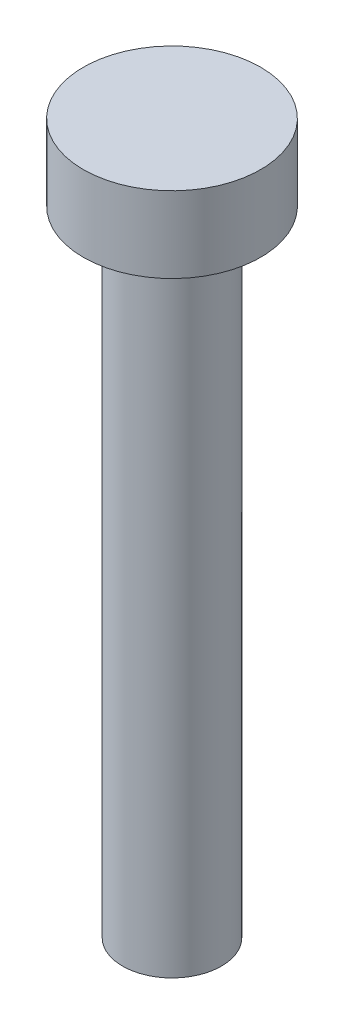
ISO-10303-21;
HEADER;
FILE_DESCRIPTION(('STEP AP214'),'2;1');
FILE_NAME('part.step','',(''),(''),'','','');
FILE_SCHEMA(('AUTOMOTIVE_DESIGN { 1 0 10303 214 1 1 1 1 }'));
ENDSEC;
DATA;
#1=APPLICATION_CONTEXT('core data for automotive mechanical design processes');
#2=APPLICATION_PROTOCOL_DEFINITION('international standard','automotive_design',2000,#1);
#3=PRODUCT_CONTEXT('',#1,'mechanical');
#4=PRODUCT('Part','Part','',(#3));
#5=PRODUCT_RELATED_PRODUCT_CATEGORY('part','',(#4));
#6=PRODUCT_DEFINITION_FORMATION('','',#4);
#7=PRODUCT_DEFINITION_CONTEXT('part definition',#1,'design');
#8=PRODUCT_DEFINITION('design','',#6,#7);
#9=PRODUCT_DEFINITION_SHAPE('','',#8);
#10=(LENGTH_UNIT() NAMED_UNIT(*) SI_UNIT(.MILLI.,.METRE.));
#11=(NAMED_UNIT(*) PLANE_ANGLE_UNIT() SI_UNIT($,.RADIAN.));
#12=(NAMED_UNIT(*) SI_UNIT($,.STERADIAN.) SOLID_ANGLE_UNIT());
#13=UNCERTAINTY_MEASURE_WITH_UNIT(LENGTH_MEASURE(1.E-05),#10,'distance_accuracy_value','');
#14=(GEOMETRIC_REPRESENTATION_CONTEXT(3) GLOBAL_UNCERTAINTY_ASSIGNED_CONTEXT((#13)) GLOBAL_UNIT_ASSIGNED_CONTEXT((#10,
#11,#12)) REPRESENTATION_CONTEXT('',''));
#15=CARTESIAN_POINT('',(0.,0.,0.));
#16=DIRECTION('',(0.,0.,1.));
#17=DIRECTION('',(1.,0.,0.));
#18=AXIS2_PLACEMENT_3D('',#15,#16,#17);
#19=CARTESIAN_POINT('',(0.,3.,0.));
#20=DIRECTION('',(0.,-1.,0.));
#21=DIRECTION('',(0.,0.,-1.));
#22=AXIS2_PLACEMENT_3D('',#19,#20,#21);
#23=CYLINDRICAL_SURFACE('',#22,3.5);
#24=CARTESIAN_POINT('',(0.,3.,0.));
#25=DIRECTION('',(0.,1.,0.));
#26=DIRECTION('',(0.,0.,1.));
#27=AXIS2_PLACEMENT_3D('',#24,#25,#26);
#28=CIRCLE('',#27,3.5);
#29=CARTESIAN_POINT('',(0.,3.,3.5));
#30=VERTEX_POINT('',#29);
#31=EDGE_CURVE('E40',#30,#30,#28,.T.);
#32=ORIENTED_EDGE('',*,*,#31,.F.);
#33=EDGE_LOOP('',(#32));
#34=FACE_BOUND('',#33,.T.);
#35=CARTESIAN_POINT('',(0.,0.,0.));
#36=DIRECTION('',(0.,1.,0.));
#37=DIRECTION('',(0.,0.,1.));
#38=AXIS2_PLACEMENT_3D('',#35,#36,#37);
#39=CIRCLE('',#38,3.5);
#40=CARTESIAN_POINT('',(0.,0.,3.5));
#41=VERTEX_POINT('',#40);
#42=EDGE_CURVE('E36',#41,#41,#39,.T.);
#43=ORIENTED_EDGE('',*,*,#42,.T.);
#44=EDGE_LOOP('',(#43));
#45=FACE_BOUND('',#44,.T.);
#46=ADVANCED_FACE('F33',(#34,#45),#23,.T.);
#47=CARTESIAN_POINT('',(0.,3.,0.));
#48=DIRECTION('',(0.,1.,0.));
#49=DIRECTION('',(0.,0.,1.));
#50=AXIS2_PLACEMENT_3D('',#47,#48,#49);
#51=PLANE('',#50);
#52=ORIENTED_EDGE('',*,*,#31,.T.);
#53=EDGE_LOOP('',(#52));
#54=FACE_BOUND('',#53,.T.);
#55=ADVANCED_FACE('F57',(#54),#51,.T.);
#56=CARTESIAN_POINT('',(0.,0.,0.));
#57=DIRECTION('',(0.,1.,0.));
#58=DIRECTION('',(0.,0.,1.));
#59=AXIS2_PLACEMENT_3D('',#56,#57,#58);
#60=PLANE('',#59);
#61=CARTESIAN_POINT('',(0.,0.,0.));
#62=DIRECTION('',(0.,-1.,0.));
#63=DIRECTION('',(0.,0.,-1.));
#64=AXIS2_PLACEMENT_3D('',#61,#62,#63);
#65=CIRCLE('',#64,1.95);
#66=CARTESIAN_POINT('',(0.,0.,-1.95));
#67=VERTEX_POINT('',#66);
#68=EDGE_CURVE('E10',#67,#67,#65,.T.);
#69=ORIENTED_EDGE('',*,*,#68,.F.);
#70=EDGE_LOOP('',(#69));
#71=FACE_BOUND('',#70,.T.);
#72=ORIENTED_EDGE('',*,*,#42,.F.);
#73=EDGE_LOOP('',(#72));
#74=FACE_BOUND('',#73,.T.);
#75=ADVANCED_FACE('F54',(#71,#74),#60,.F.);
#76=CARTESIAN_POINT('',(0.,-25.,0.));
#77=DIRECTION('',(0.,1.,0.));
#78=DIRECTION('',(0.,0.,1.));
#79=AXIS2_PLACEMENT_3D('',#76,#77,#78);
#80=CYLINDRICAL_SURFACE('',#79,1.95);
#81=CARTESIAN_POINT('',(0.,-25.,0.));
#82=DIRECTION('',(0.,-1.,0.));
#83=DIRECTION('',(0.,0.,-1.));
#84=AXIS2_PLACEMENT_3D('',#81,#82,#83);
#85=CIRCLE('',#84,1.95);
#86=CARTESIAN_POINT('',(0.,-25.,-1.95));
#87=VERTEX_POINT('',#86);
#88=EDGE_CURVE('E46',#87,#87,#85,.T.);
#89=ORIENTED_EDGE('',*,*,#88,.F.);
#90=EDGE_LOOP('',(#89));
#91=FACE_BOUND('',#90,.T.);
#92=ORIENTED_EDGE('',*,*,#68,.T.);
#93=EDGE_LOOP('',(#92));
#94=FACE_BOUND('',#93,.T.);
#95=ADVANCED_FACE('F56',(#91,#94),#80,.T.);
#96=CARTESIAN_POINT('',(0.,-25.,0.));
#97=DIRECTION('',(0.,-1.,0.));
#98=DIRECTION('',(0.,0.,-1.));
#99=AXIS2_PLACEMENT_3D('',#96,#97,#98);
#100=PLANE('',#99);
#101=ORIENTED_EDGE('',*,*,#88,.T.);
#102=EDGE_LOOP('',(#101));
#103=FACE_BOUND('',#102,.T.);
#104=ADVANCED_FACE('F63',(#103),#100,.T.);
#105=CLOSED_SHELL('',(#46,#55,#75,#95,#104));
#106=MANIFOLD_SOLID_BREP('B2',#105);
#107=ADVANCED_BREP_SHAPE_REPRESENTATION('',(#18,#106),#14);
#108=SHAPE_DEFINITION_REPRESENTATION(#9,#107);
ENDSEC;
END-ISO-10303-21;
